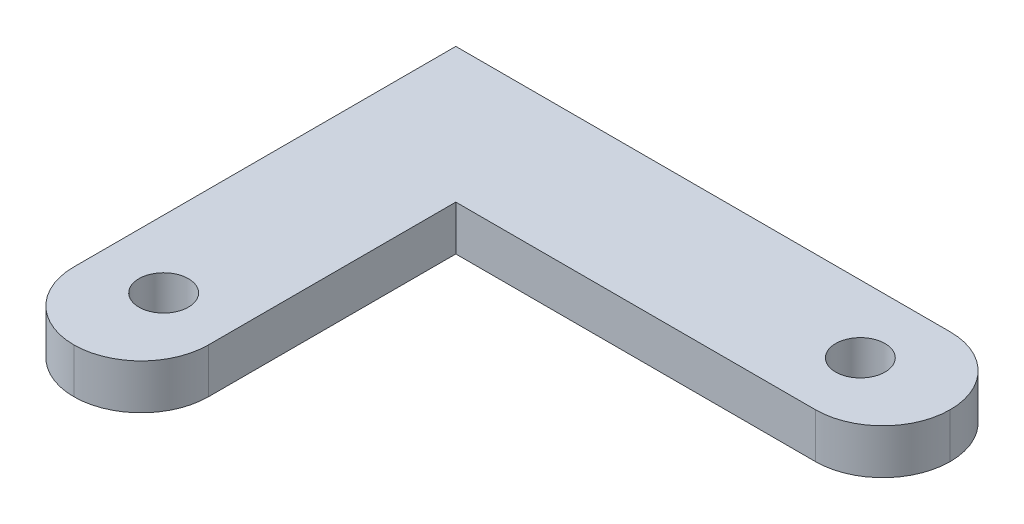
ISO-10303-21;
HEADER;
FILE_DESCRIPTION(('STEP AP214'),'2;1');
FILE_NAME('part.step','',(''),(''),'','','');
FILE_SCHEMA(('AUTOMOTIVE_DESIGN { 1 0 10303 214 1 1 1 1 }'));
ENDSEC;
DATA;
#1=APPLICATION_CONTEXT('core data for automotive mechanical design processes');
#2=APPLICATION_PROTOCOL_DEFINITION('international standard','automotive_design',2000,#1);
#3=PRODUCT_CONTEXT('',#1,'mechanical');
#4=PRODUCT('Part','Part','',(#3));
#5=PRODUCT_RELATED_PRODUCT_CATEGORY('part','',(#4));
#6=PRODUCT_DEFINITION_FORMATION('','',#4);
#7=PRODUCT_DEFINITION_CONTEXT('part definition',#1,'design');
#8=PRODUCT_DEFINITION('design','',#6,#7);
#9=PRODUCT_DEFINITION_SHAPE('','',#8);
#10=(LENGTH_UNIT() NAMED_UNIT(*) SI_UNIT(.MILLI.,.METRE.));
#11=(NAMED_UNIT(*) PLANE_ANGLE_UNIT() SI_UNIT($,.RADIAN.));
#12=(NAMED_UNIT(*) SI_UNIT($,.STERADIAN.) SOLID_ANGLE_UNIT());
#13=UNCERTAINTY_MEASURE_WITH_UNIT(LENGTH_MEASURE(1.E-05),#10,'distance_accuracy_value','');
#14=(GEOMETRIC_REPRESENTATION_CONTEXT(3) GLOBAL_UNCERTAINTY_ASSIGNED_CONTEXT((#13)) GLOBAL_UNIT_ASSIGNED_CONTEXT((#10,
#11,#12)) REPRESENTATION_CONTEXT('',''));
#15=CARTESIAN_POINT('',(0.,0.,0.));
#16=DIRECTION('',(0.,0.,1.));
#17=DIRECTION('',(1.,0.,0.));
#18=AXIS2_PLACEMENT_3D('',#15,#16,#17);
#19=CARTESIAN_POINT('',(19.,2.,-6.));
#20=DIRECTION('',(0.,0.,1.));
#21=DIRECTION('',(1.,0.,0.));
#22=AXIS2_PLACEMENT_3D('',#19,#20,#21);
#23=PLANE('',#22);
#24=DIRECTION('',(-1.,0.,0.));
#25=VECTOR('',#24,1.);
#26=CARTESIAN_POINT('',(19.,2.,-6.));
#27=LINE('',#26,#25);
#28=CARTESIAN_POINT('',(16.,2.,-6.));
#29=VERTEX_POINT('',#28);
#30=CARTESIAN_POINT('',(-6.,2.,-6.));
#31=VERTEX_POINT('',#30);
#32=EDGE_CURVE('E111',#29,#31,#27,.T.);
#33=ORIENTED_EDGE('',*,*,#32,.F.);
#34=DIRECTION('',(0.,-1.,0.));
#35=VECTOR('',#34,1.);
#36=CARTESIAN_POINT('',(16.,2.,-6.));
#37=LINE('',#36,#35);
#38=CARTESIAN_POINT('',(16.,0.,-6.));
#39=VERTEX_POINT('',#38);
#40=EDGE_CURVE('E138',#29,#39,#37,.T.);
#41=ORIENTED_EDGE('',*,*,#40,.T.);
#42=DIRECTION('',(-1.,0.,0.));
#43=VECTOR('',#42,1.);
#44=CARTESIAN_POINT('',(19.,0.,-6.));
#45=LINE('',#44,#43);
#46=CARTESIAN_POINT('',(-6.,0.,-6.));
#47=VERTEX_POINT('',#46);
#48=EDGE_CURVE('E135',#39,#47,#45,.T.);
#49=ORIENTED_EDGE('',*,*,#48,.T.);
#50=DIRECTION('',(0.,-1.,0.));
#51=VECTOR('',#50,1.);
#52=CARTESIAN_POINT('',(-6.,2.,-6.));
#53=LINE('',#52,#51);
#54=EDGE_CURVE('E129',#31,#47,#53,.T.);
#55=ORIENTED_EDGE('',*,*,#54,.F.);
#56=EDGE_LOOP('',(#33,#41,#49,#55));
#57=FACE_BOUND('',#56,.T.);
#58=ADVANCED_FACE('F43',(#57),#23,.F.);
#59=CARTESIAN_POINT('',(-6.,2.,-6.));
#60=DIRECTION('',(1.,0.,0.));
#61=DIRECTION('',(0.,0.,-1.));
#62=AXIS2_PLACEMENT_3D('',#59,#60,#61);
#63=PLANE('',#62);
#64=DIRECTION('',(0.,0.,1.));
#65=VECTOR('',#64,1.);
#66=CARTESIAN_POINT('',(-6.,0.,-6.));
#67=LINE('',#66,#65);
#68=CARTESIAN_POINT('',(-6.,0.,11.));
#69=VERTEX_POINT('',#68);
#70=EDGE_CURVE('E205',#47,#69,#67,.T.);
#71=ORIENTED_EDGE('',*,*,#70,.T.);
#72=DIRECTION('',(0.,-1.,0.));
#73=VECTOR('',#72,1.);
#74=CARTESIAN_POINT('',(-6.,2.,11.));
#75=LINE('',#74,#73);
#76=CARTESIAN_POINT('',(-6.,2.,11.));
#77=VERTEX_POINT('',#76);
#78=EDGE_CURVE('E53',#69,#77,#75,.F.);
#79=ORIENTED_EDGE('',*,*,#78,.T.);
#80=DIRECTION('',(0.,0.,1.));
#81=VECTOR('',#80,1.);
#82=CARTESIAN_POINT('',(-6.,2.,-6.));
#83=LINE('',#82,#81);
#84=EDGE_CURVE('E114',#31,#77,#83,.T.);
#85=ORIENTED_EDGE('',*,*,#84,.F.);
#86=ORIENTED_EDGE('',*,*,#54,.T.);
#87=EDGE_LOOP('',(#71,#79,#85,#86));
#88=FACE_BOUND('',#87,.T.);
#89=ADVANCED_FACE('F128',(#88),#63,.F.);
#90=CARTESIAN_POINT('',(0.,2.,14.));
#91=DIRECTION('',(-1.,0.,0.));
#92=DIRECTION('',(0.,0.,1.));
#93=AXIS2_PLACEMENT_3D('',#90,#91,#92);
#94=PLANE('',#93);
#95=DIRECTION('',(0.,0.,-1.));
#96=VECTOR('',#95,1.);
#97=CARTESIAN_POINT('',(0.,2.,14.));
#98=LINE('',#97,#96);
#99=CARTESIAN_POINT('',(0.,2.,11.));
#100=VERTEX_POINT('',#99);
#101=CARTESIAN_POINT('',(0.,2.,0.));
#102=VERTEX_POINT('',#101);
#103=EDGE_CURVE('E132',#100,#102,#98,.T.);
#104=ORIENTED_EDGE('',*,*,#103,.F.);
#105=DIRECTION('',(0.,-1.,0.));
#106=VECTOR('',#105,1.);
#107=CARTESIAN_POINT('',(0.,2.,11.));
#108=LINE('',#107,#106);
#109=CARTESIAN_POINT('',(0.,0.,11.));
#110=VERTEX_POINT('',#109);
#111=EDGE_CURVE('E11',#100,#110,#108,.T.);
#112=ORIENTED_EDGE('',*,*,#111,.T.);
#113=DIRECTION('',(0.,0.,-1.));
#114=VECTOR('',#113,1.);
#115=CARTESIAN_POINT('',(0.,0.,14.));
#116=LINE('',#115,#114);
#117=CARTESIAN_POINT('',(0.,0.,0.));
#118=VERTEX_POINT('',#117);
#119=EDGE_CURVE('E209',#110,#118,#116,.T.);
#120=ORIENTED_EDGE('',*,*,#119,.T.);
#121=DIRECTION('',(0.,-1.,0.));
#122=VECTOR('',#121,1.);
#123=CARTESIAN_POINT('',(0.,2.,0.));
#124=LINE('',#123,#122);
#125=EDGE_CURVE('E139',#102,#118,#124,.T.);
#126=ORIENTED_EDGE('',*,*,#125,.F.);
#127=EDGE_LOOP('',(#104,#112,#120,#126));
#128=FACE_BOUND('',#127,.T.);
#129=ADVANCED_FACE('F196',(#128),#94,.F.);
#130=CARTESIAN_POINT('',(0.,2.,0.));
#131=DIRECTION('',(0.,0.,-1.));
#132=DIRECTION('',(-1.,0.,0.));
#133=AXIS2_PLACEMENT_3D('',#130,#131,#132);
#134=PLANE('',#133);
#135=DIRECTION('',(1.,0.,0.));
#136=VECTOR('',#135,1.);
#137=CARTESIAN_POINT('',(0.,0.,0.));
#138=LINE('',#137,#136);
#139=CARTESIAN_POINT('',(16.,0.,0.));
#140=VERTEX_POINT('',#139);
#141=EDGE_CURVE('E122',#118,#140,#138,.T.);
#142=ORIENTED_EDGE('',*,*,#141,.T.);
#143=DIRECTION('',(0.,-1.,0.));
#144=VECTOR('',#143,1.);
#145=CARTESIAN_POINT('',(16.,2.,0.));
#146=LINE('',#145,#144);
#147=CARTESIAN_POINT('',(16.,2.,0.));
#148=VERTEX_POINT('',#147);
#149=EDGE_CURVE('E69',#140,#148,#146,.F.);
#150=ORIENTED_EDGE('',*,*,#149,.T.);
#151=DIRECTION('',(1.,0.,0.));
#152=VECTOR('',#151,1.);
#153=CARTESIAN_POINT('',(0.,2.,0.));
#154=LINE('',#153,#152);
#155=EDGE_CURVE('E146',#102,#148,#154,.T.);
#156=ORIENTED_EDGE('',*,*,#155,.F.);
#157=ORIENTED_EDGE('',*,*,#125,.T.);
#158=EDGE_LOOP('',(#142,#150,#156,#157));
#159=FACE_BOUND('',#158,.T.);
#160=ADVANCED_FACE('F213',(#159),#134,.F.);
#161=CARTESIAN_POINT('',(0.,2.,0.));
#162=DIRECTION('',(0.,1.,0.));
#163=DIRECTION('',(0.,0.,1.));
#164=AXIS2_PLACEMENT_3D('',#161,#162,#163);
#165=PLANE('',#164);
#166=CARTESIAN_POINT('',(-3.,2.,10.));
#167=DIRECTION('',(0.,1.,0.));
#168=DIRECTION('',(0.,0.,1.));
#169=AXIS2_PLACEMENT_3D('',#166,#167,#168);
#170=CIRCLE('',#169,1.1);
#171=CARTESIAN_POINT('',(-3.,2.,11.1));
#172=VERTEX_POINT('',#171);
#173=EDGE_CURVE('E350',#172,#172,#170,.T.);
#174=ORIENTED_EDGE('',*,*,#173,.F.);
#175=EDGE_LOOP('',(#174));
#176=FACE_BOUND('',#175,.T.);
#177=CARTESIAN_POINT('',(15.,2.,-3.));
#178=DIRECTION('',(0.,1.,0.));
#179=DIRECTION('',(0.,0.,1.));
#180=AXIS2_PLACEMENT_3D('',#177,#178,#179);
#181=CIRCLE('',#180,1.1);
#182=CARTESIAN_POINT('',(15.,2.,-1.9));
#183=VERTEX_POINT('',#182);
#184=EDGE_CURVE('E182',#183,#183,#181,.T.);
#185=ORIENTED_EDGE('',*,*,#184,.F.);
#186=EDGE_LOOP('',(#185));
#187=FACE_BOUND('',#186,.T.);
#188=CARTESIAN_POINT('',(16.,2.,-3.));
#189=DIRECTION('',(0.,1.,0.));
#190=DIRECTION('',(0.,0.,1.));
#191=AXIS2_PLACEMENT_3D('',#188,#189,#190);
#192=CIRCLE('',#191,3.);
#193=CARTESIAN_POINT('',(19.,2.,-3.));
#194=VERTEX_POINT('',#193);
#195=EDGE_CURVE('E61',#148,#194,#192,.T.);
#196=ORIENTED_EDGE('',*,*,#195,.T.);
#197=CARTESIAN_POINT('',(16.,2.,-3.));
#198=DIRECTION('',(0.,1.,0.));
#199=DIRECTION('',(0.,0.,1.));
#200=AXIS2_PLACEMENT_3D('',#197,#198,#199);
#201=CIRCLE('',#200,3.);
#202=EDGE_CURVE('E116',#194,#29,#201,.T.);
#203=ORIENTED_EDGE('',*,*,#202,.T.);
#204=ORIENTED_EDGE('',*,*,#32,.T.);
#205=ORIENTED_EDGE('',*,*,#84,.T.);
#206=CARTESIAN_POINT('',(-3.,2.,11.));
#207=DIRECTION('',(0.,1.,0.));
#208=DIRECTION('',(0.,0.,1.));
#209=AXIS2_PLACEMENT_3D('',#206,#207,#208);
#210=CIRCLE('',#209,3.);
#211=CARTESIAN_POINT('',(-3.,2.,14.));
#212=VERTEX_POINT('',#211);
#213=EDGE_CURVE('E164',#77,#212,#210,.T.);
#214=ORIENTED_EDGE('',*,*,#213,.T.);
#215=CARTESIAN_POINT('',(-3.,2.,11.));
#216=DIRECTION('',(0.,1.,0.));
#217=DIRECTION('',(0.,0.,1.));
#218=AXIS2_PLACEMENT_3D('',#215,#216,#217);
#219=CIRCLE('',#218,3.);
#220=EDGE_CURVE('E161',#212,#100,#219,.T.);
#221=ORIENTED_EDGE('',*,*,#220,.T.);
#222=ORIENTED_EDGE('',*,*,#103,.T.);
#223=ORIENTED_EDGE('',*,*,#155,.T.);
#224=EDGE_LOOP('',(#196,#203,#204,#205,#214,#221,#222,#223));
#225=FACE_BOUND('',#224,.T.);
#226=ADVANCED_FACE('F113',(#176,#187,#225),#165,.T.);
#227=CARTESIAN_POINT('',(0.,0.,0.));
#228=DIRECTION('',(0.,1.,0.));
#229=DIRECTION('',(0.,0.,1.));
#230=AXIS2_PLACEMENT_3D('',#227,#228,#229);
#231=PLANE('',#230);
#232=CARTESIAN_POINT('',(-3.,0.,10.));
#233=DIRECTION('',(0.,1.,0.));
#234=DIRECTION('',(0.,0.,1.));
#235=AXIS2_PLACEMENT_3D('',#232,#233,#234);
#236=CIRCLE('',#235,1.1);
#237=CARTESIAN_POINT('',(-3.,0.,11.1));
#238=VERTEX_POINT('',#237);
#239=EDGE_CURVE('E206',#238,#238,#236,.T.);
#240=ORIENTED_EDGE('',*,*,#239,.T.);
#241=EDGE_LOOP('',(#240));
#242=FACE_BOUND('',#241,.T.);
#243=CARTESIAN_POINT('',(15.,0.,-3.));
#244=DIRECTION('',(0.,1.,0.));
#245=DIRECTION('',(0.,0.,1.));
#246=AXIS2_PLACEMENT_3D('',#243,#244,#245);
#247=CIRCLE('',#246,1.1);
#248=CARTESIAN_POINT('',(15.,0.,-1.9));
#249=VERTEX_POINT('',#248);
#250=EDGE_CURVE('E177',#249,#249,#247,.T.);
#251=ORIENTED_EDGE('',*,*,#250,.T.);
#252=EDGE_LOOP('',(#251));
#253=FACE_BOUND('',#252,.T.);
#254=ORIENTED_EDGE('',*,*,#48,.F.);
#255=CARTESIAN_POINT('',(16.,0.,-3.));
#256=DIRECTION('',(0.,1.,0.));
#257=DIRECTION('',(0.,0.,1.));
#258=AXIS2_PLACEMENT_3D('',#255,#256,#257);
#259=CIRCLE('',#258,3.);
#260=CARTESIAN_POINT('',(19.,0.,-3.));
#261=VERTEX_POINT('',#260);
#262=EDGE_CURVE('E158',#39,#261,#259,.F.);
#263=ORIENTED_EDGE('',*,*,#262,.T.);
#264=CARTESIAN_POINT('',(16.,0.,-3.));
#265=DIRECTION('',(0.,1.,0.));
#266=DIRECTION('',(0.,0.,1.));
#267=AXIS2_PLACEMENT_3D('',#264,#265,#266);
#268=CIRCLE('',#267,3.);
#269=EDGE_CURVE('E155',#261,#140,#268,.F.);
#270=ORIENTED_EDGE('',*,*,#269,.T.);
#271=ORIENTED_EDGE('',*,*,#141,.F.);
#272=ORIENTED_EDGE('',*,*,#119,.F.);
#273=CARTESIAN_POINT('',(-3.,0.,11.));
#274=DIRECTION('',(0.,1.,0.));
#275=DIRECTION('',(0.,0.,1.));
#276=AXIS2_PLACEMENT_3D('',#273,#274,#275);
#277=CIRCLE('',#276,3.);
#278=CARTESIAN_POINT('',(-3.,0.,14.));
#279=VERTEX_POINT('',#278);
#280=EDGE_CURVE('E143',#110,#279,#277,.F.);
#281=ORIENTED_EDGE('',*,*,#280,.T.);
#282=CARTESIAN_POINT('',(-3.,0.,11.));
#283=DIRECTION('',(0.,1.,0.));
#284=DIRECTION('',(0.,0.,1.));
#285=AXIS2_PLACEMENT_3D('',#282,#283,#284);
#286=CIRCLE('',#285,3.);
#287=EDGE_CURVE('E152',#279,#69,#286,.F.);
#288=ORIENTED_EDGE('',*,*,#287,.T.);
#289=ORIENTED_EDGE('',*,*,#70,.F.);
#290=EDGE_LOOP('',(#254,#263,#270,#271,#272,#281,#288,#289));
#291=FACE_BOUND('',#290,.T.);
#292=ADVANCED_FACE('F219',(#242,#253,#291),#231,.F.);
#293=CARTESIAN_POINT('',(15.,0.,-3.));
#294=DIRECTION('',(0.,1.,0.));
#295=DIRECTION('',(0.,0.,1.));
#296=AXIS2_PLACEMENT_3D('',#293,#294,#295);
#297=CYLINDRICAL_SURFACE('',#296,1.1);
#298=ORIENTED_EDGE('',*,*,#250,.F.);
#299=EDGE_LOOP('',(#298));
#300=FACE_BOUND('',#299,.T.);
#301=ORIENTED_EDGE('',*,*,#184,.T.);
#302=EDGE_LOOP('',(#301));
#303=FACE_BOUND('',#302,.T.);
#304=ADVANCED_FACE('F221',(#300,#303),#297,.F.);
#305=CARTESIAN_POINT('',(-3.,0.,10.));
#306=DIRECTION('',(0.,1.,0.));
#307=DIRECTION('',(0.,0.,1.));
#308=AXIS2_PLACEMENT_3D('',#305,#306,#307);
#309=CYLINDRICAL_SURFACE('',#308,1.1);
#310=ORIENTED_EDGE('',*,*,#239,.F.);
#311=EDGE_LOOP('',(#310));
#312=FACE_BOUND('',#311,.T.);
#313=ORIENTED_EDGE('',*,*,#173,.T.);
#314=EDGE_LOOP('',(#313));
#315=FACE_BOUND('',#314,.T.);
#316=ADVANCED_FACE('F228',(#312,#315),#309,.F.);
#317=CARTESIAN_POINT('',(16.,2.,-3.));
#318=DIRECTION('',(0.,-1.,0.));
#319=DIRECTION('',(0.,0.,-1.));
#320=AXIS2_PLACEMENT_3D('',#317,#318,#319);
#321=CYLINDRICAL_SURFACE('',#320,3.);
#322=DIRECTION('',(0.,-1.,0.));
#323=VECTOR('',#322,1.);
#324=CARTESIAN_POINT('',(19.,2.,-3.));
#325=LINE('',#324,#323);
#326=EDGE_CURVE('E174',#194,#261,#325,.T.);
#327=ORIENTED_EDGE('',*,*,#326,.F.);
#328=ORIENTED_EDGE('',*,*,#195,.F.);
#329=ORIENTED_EDGE('',*,*,#149,.F.);
#330=ORIENTED_EDGE('',*,*,#269,.F.);
#331=EDGE_LOOP('',(#327,#328,#329,#330));
#332=FACE_BOUND('',#331,.T.);
#333=ADVANCED_FACE('F217',(#332),#321,.T.);
#334=CARTESIAN_POINT('',(16.,2.,-3.));
#335=DIRECTION('',(0.,-1.,0.));
#336=DIRECTION('',(0.,0.,-1.));
#337=AXIS2_PLACEMENT_3D('',#334,#335,#336);
#338=CYLINDRICAL_SURFACE('',#337,3.);
#339=ORIENTED_EDGE('',*,*,#202,.F.);
#340=ORIENTED_EDGE('',*,*,#326,.T.);
#341=ORIENTED_EDGE('',*,*,#262,.F.);
#342=ORIENTED_EDGE('',*,*,#40,.F.);
#343=EDGE_LOOP('',(#339,#340,#341,#342));
#344=FACE_BOUND('',#343,.T.);
#345=ADVANCED_FACE('F218',(#344),#338,.T.);
#346=CARTESIAN_POINT('',(-3.,2.,11.));
#347=DIRECTION('',(0.,-1.,0.));
#348=DIRECTION('',(0.,0.,-1.));
#349=AXIS2_PLACEMENT_3D('',#346,#347,#348);
#350=CYLINDRICAL_SURFACE('',#349,3.);
#351=ORIENTED_EDGE('',*,*,#111,.F.);
#352=ORIENTED_EDGE('',*,*,#220,.F.);
#353=DIRECTION('',(0.,-1.,0.));
#354=VECTOR('',#353,1.);
#355=CARTESIAN_POINT('',(-3.,2.,14.));
#356=LINE('',#355,#354);
#357=EDGE_CURVE('E47',#279,#212,#356,.F.);
#358=ORIENTED_EDGE('',*,*,#357,.F.);
#359=ORIENTED_EDGE('',*,*,#280,.F.);
#360=EDGE_LOOP('',(#351,#352,#358,#359));
#361=FACE_BOUND('',#360,.T.);
#362=ADVANCED_FACE('F45',(#361),#350,.T.);
#363=CARTESIAN_POINT('',(-3.,2.,11.));
#364=DIRECTION('',(0.,-1.,0.));
#365=DIRECTION('',(0.,0.,-1.));
#366=AXIS2_PLACEMENT_3D('',#363,#364,#365);
#367=CYLINDRICAL_SURFACE('',#366,3.);
#368=ORIENTED_EDGE('',*,*,#213,.F.);
#369=ORIENTED_EDGE('',*,*,#78,.F.);
#370=ORIENTED_EDGE('',*,*,#287,.F.);
#371=ORIENTED_EDGE('',*,*,#357,.T.);
#372=EDGE_LOOP('',(#368,#369,#370,#371));
#373=FACE_BOUND('',#372,.T.);
#374=ADVANCED_FACE('F188',(#373),#367,.T.);
#375=CLOSED_SHELL('',(#58,#89,#129,#160,#226,#292,#304,#316,#333,#345,#362,#374));
#376=MANIFOLD_SOLID_BREP('B2',#375);
#377=ADVANCED_BREP_SHAPE_REPRESENTATION('',(#18,#376),#14);
#378=SHAPE_DEFINITION_REPRESENTATION(#9,#377);
ENDSEC;
END-ISO-10303-21;
